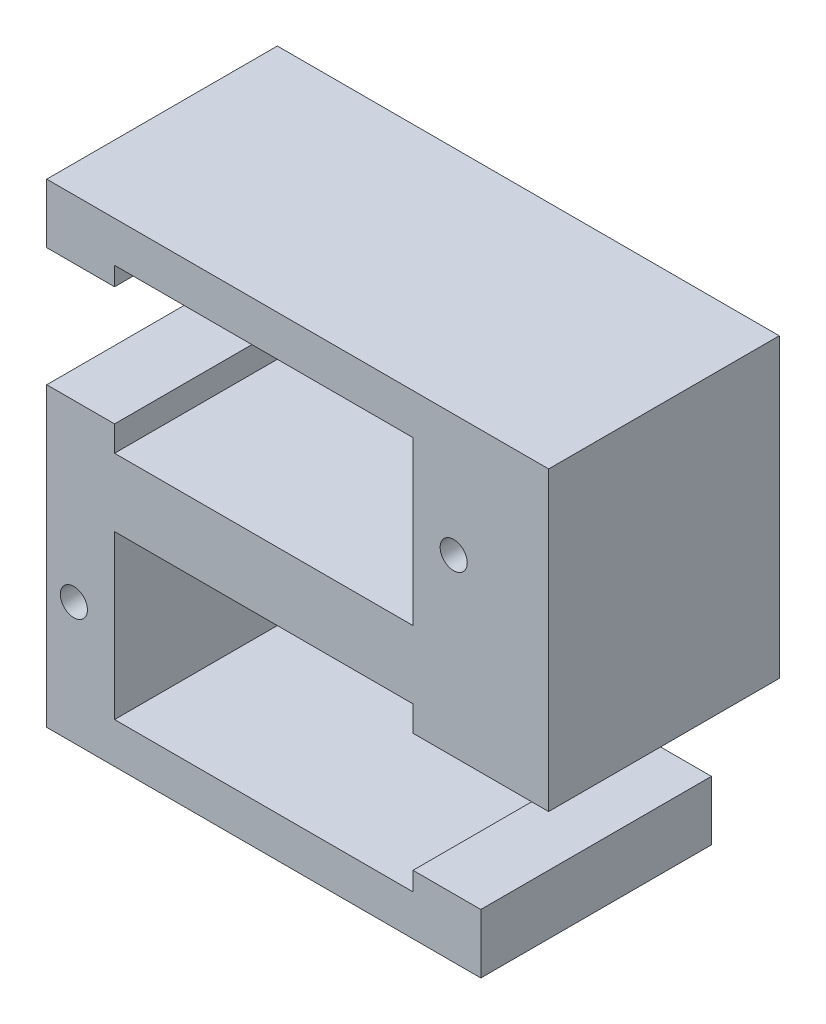
ISO-10303-21;
HEADER;
FILE_DESCRIPTION(('STEP AP214'),'2;1');
FILE_NAME('part.step','',(''),(''),'','','');
FILE_SCHEMA(('AUTOMOTIVE_DESIGN { 1 0 10303 214 1 1 1 1 }'));
ENDSEC;
DATA;
#1=APPLICATION_CONTEXT('core data for automotive mechanical design processes');
#2=APPLICATION_PROTOCOL_DEFINITION('international standard','automotive_design',2000,#1);
#3=PRODUCT_CONTEXT('',#1,'mechanical');
#4=PRODUCT('Part','Part','',(#3));
#5=PRODUCT_RELATED_PRODUCT_CATEGORY('part','',(#4));
#6=PRODUCT_DEFINITION_FORMATION('','',#4);
#7=PRODUCT_DEFINITION_CONTEXT('part definition',#1,'design');
#8=PRODUCT_DEFINITION('design','',#6,#7);
#9=PRODUCT_DEFINITION_SHAPE('','',#8);
#10=(LENGTH_UNIT() NAMED_UNIT(*) SI_UNIT(.MILLI.,.METRE.));
#11=(NAMED_UNIT(*) PLANE_ANGLE_UNIT() SI_UNIT($,.RADIAN.));
#12=(NAMED_UNIT(*) SI_UNIT($,.STERADIAN.) SOLID_ANGLE_UNIT());
#13=UNCERTAINTY_MEASURE_WITH_UNIT(LENGTH_MEASURE(1.E-05),#10,'distance_accuracy_value','');
#14=(GEOMETRIC_REPRESENTATION_CONTEXT(3) GLOBAL_UNCERTAINTY_ASSIGNED_CONTEXT((#13)) GLOBAL_UNIT_ASSIGNED_CONTEXT((#10,
#11,#12)) REPRESENTATION_CONTEXT('',''));
#15=CARTESIAN_POINT('',(0.,0.,0.));
#16=DIRECTION('',(0.,0.,1.));
#17=DIRECTION('',(1.,0.,0.));
#18=AXIS2_PLACEMENT_3D('',#15,#16,#17);
#19=CARTESIAN_POINT('',(16.1122382547684,0.,-35.));
#20=DIRECTION('',(-1.,0.,0.));
#21=DIRECTION('',(0.,-1.,0.));
#22=AXIS2_PLACEMENT_3D('',#19,#20,#21);
#23=PLANE('',#22);
#24=DIRECTION('',(0.,0.,1.));
#25=VECTOR('',#24,1.);
#26=CARTESIAN_POINT('',(16.1122382547684,40.9799365132959,-35.));
#27=LINE('',#26,#25);
#28=CARTESIAN_POINT('',(16.1122382547684,40.9799365132959,-32.));
#29=VERTEX_POINT('',#28);
#30=CARTESIAN_POINT('',(16.1122382547684,40.9799365132959,-15.));
#31=VERTEX_POINT('',#30);
#32=EDGE_CURVE('E45',#29,#31,#27,.T.);
#33=ORIENTED_EDGE('',*,*,#32,.F.);
#34=DIRECTION('',(0.,1.,0.));
#35=VECTOR('',#34,1.);
#36=CARTESIAN_POINT('',(16.1122382547684,75.9799365132959,-32.));
#37=LINE('',#36,#35);
#38=CARTESIAN_POINT('',(16.1122382547684,45.3549365132959,-32.));
#39=VERTEX_POINT('',#38);
#40=EDGE_CURVE('E212',#29,#39,#37,.T.);
#41=ORIENTED_EDGE('',*,*,#40,.T.);
#42=DIRECTION('',(0.,0.,-1.));
#43=VECTOR('',#42,1.);
#44=CARTESIAN_POINT('',(16.1122382547684,45.3549365132959,-35.));
#45=LINE('',#44,#43);
#46=CARTESIAN_POINT('',(16.1122382547684,45.3549365132959,-15.));
#47=VERTEX_POINT('',#46);
#48=EDGE_CURVE('E253',#47,#39,#45,.T.);
#49=ORIENTED_EDGE('',*,*,#48,.F.);
#50=DIRECTION('',(0.,1.,0.));
#51=VECTOR('',#50,1.);
#52=CARTESIAN_POINT('',(16.1122382547684,75.9799365132959,-15.));
#53=LINE('',#52,#51);
#54=EDGE_CURVE('E273',#31,#47,#53,.T.);
#55=ORIENTED_EDGE('',*,*,#54,.F.);
#56=EDGE_LOOP('',(#33,#41,#49,#55));
#57=FACE_BOUND('',#56,.T.);
#58=ADVANCED_FACE('F37',(#57),#23,.F.);
#59=CARTESIAN_POINT('',(11.1122380163498,0.,-35.));
#60=DIRECTION('',(-1.,0.,0.));
#61=DIRECTION('',(0.,0.,1.));
#62=AXIS2_PLACEMENT_3D('',#59,#60,#61);
#63=PLANE('',#62);
#64=DIRECTION('',(0.,1.,0.));
#65=VECTOR('',#64,1.);
#66=CARTESIAN_POINT('',(11.1122380163498,0.,-32.));
#67=LINE('',#66,#65);
#68=CARTESIAN_POINT('',(11.1122380163498,43.9799365132959,-32.));
#69=VERTEX_POINT('',#68);
#70=CARTESIAN_POINT('',(11.1122380163498,45.3549365132959,-32.));
#71=VERTEX_POINT('',#70);
#72=EDGE_CURVE('E52',#69,#71,#67,.T.);
#73=ORIENTED_EDGE('',*,*,#72,.F.);
#74=DIRECTION('',(0.,0.,1.));
#75=VECTOR('',#74,1.);
#76=CARTESIAN_POINT('',(11.1122380163498,43.9799365132959,-35.));
#77=LINE('',#76,#75);
#78=CARTESIAN_POINT('',(11.1122380163498,43.9799365132959,-15.));
#79=VERTEX_POINT('',#78);
#80=EDGE_CURVE('E327',#69,#79,#77,.T.);
#81=ORIENTED_EDGE('',*,*,#80,.T.);
#82=DIRECTION('',(0.,-1.,0.));
#83=VECTOR('',#82,1.);
#84=CARTESIAN_POINT('',(11.1122380163498,0.,-15.));
#85=LINE('',#84,#83);
#86=CARTESIAN_POINT('',(11.1122380163498,45.3549365132959,-15.));
#87=VERTEX_POINT('',#86);
#88=EDGE_CURVE('E290',#87,#79,#85,.T.);
#89=ORIENTED_EDGE('',*,*,#88,.F.);
#90=DIRECTION('',(0.,0.,-1.));
#91=VECTOR('',#90,1.);
#92=CARTESIAN_POINT('',(11.1122380163498,45.3549365132959,-35.));
#93=LINE('',#92,#91);
#94=EDGE_CURVE('E254',#87,#71,#93,.T.);
#95=ORIENTED_EDGE('',*,*,#94,.T.);
#96=EDGE_LOOP('',(#73,#81,#89,#95));
#97=FACE_BOUND('',#96,.T.);
#98=ADVANCED_FACE('F396',(#97),#63,.T.);
#99=CARTESIAN_POINT('',(-10.8877619836502,0.,-35.));
#100=DIRECTION('',(-1.,0.,0.));
#101=DIRECTION('',(0.,-1.,0.));
#102=AXIS2_PLACEMENT_3D('',#99,#100,#101);
#103=PLANE('',#102);
#104=DIRECTION('',(0.,0.,1.));
#105=VECTOR('',#104,1.);
#106=CARTESIAN_POINT('',(-10.8877619836502,60.9799365132958,-35.));
#107=LINE('',#106,#105);
#108=CARTESIAN_POINT('',(-10.8877619836502,60.9799365132958,-32.));
#109=VERTEX_POINT('',#108);
#110=CARTESIAN_POINT('',(-10.8877619836502,60.9799365132959,-15.));
#111=VERTEX_POINT('',#110);
#112=EDGE_CURVE('E317',#109,#111,#107,.T.);
#113=ORIENTED_EDGE('',*,*,#112,.F.);
#114=DIRECTION('',(0.,1.,0.));
#115=VECTOR('',#114,1.);
#116=CARTESIAN_POINT('',(-10.8877619836502,0.,-32.));
#117=LINE('',#116,#115);
#118=CARTESIAN_POINT('',(-10.8877619836502,62.8549365132958,-32.));
#119=VERTEX_POINT('',#118);
#120=EDGE_CURVE('E236',#109,#119,#117,.T.);
#121=ORIENTED_EDGE('',*,*,#120,.T.);
#122=DIRECTION('',(0.,0.,1.));
#123=VECTOR('',#122,1.);
#124=CARTESIAN_POINT('',(-10.8877619836502,62.8549365132958,-15.));
#125=LINE('',#124,#123);
#126=CARTESIAN_POINT('',(-10.8877619836502,62.8549365132958,-15.));
#127=VERTEX_POINT('',#126);
#128=EDGE_CURVE('E261',#119,#127,#125,.T.);
#129=ORIENTED_EDGE('',*,*,#128,.T.);
#130=DIRECTION('',(0.,-1.,0.));
#131=VECTOR('',#130,1.);
#132=CARTESIAN_POINT('',(-10.8877619836502,0.,-15.));
#133=LINE('',#132,#131);
#134=EDGE_CURVE('E307',#127,#111,#133,.T.);
#135=ORIENTED_EDGE('',*,*,#134,.T.);
#136=EDGE_LOOP('',(#113,#121,#129,#135));
#137=FACE_BOUND('',#136,.T.);
#138=ADVANCED_FACE('F374',(#137),#103,.F.);
#139=CARTESIAN_POINT('',(-15.8877622220688,0.,-35.));
#140=DIRECTION('',(-1.,0.,0.));
#141=DIRECTION('',(0.,-1.,0.));
#142=AXIS2_PLACEMENT_3D('',#139,#140,#141);
#143=PLANE('',#142);
#144=DIRECTION('',(0.,1.,0.));
#145=VECTOR('',#144,1.);
#146=CARTESIAN_POINT('',(-15.8877622220688,75.9799365132959,-32.));
#147=LINE('',#146,#145);
#148=CARTESIAN_POINT('',(-15.8877622220688,40.9799365132959,-32.));
#149=VERTEX_POINT('',#148);
#150=CARTESIAN_POINT('',(-15.8877622220688,62.8549365132958,-32.));
#151=VERTEX_POINT('',#150);
#152=EDGE_CURVE('E216',#149,#151,#147,.T.);
#153=ORIENTED_EDGE('',*,*,#152,.F.);
#154=DIRECTION('',(0.,0.,1.));
#155=VECTOR('',#154,1.);
#156=CARTESIAN_POINT('',(-15.8877622220688,40.9799365132959,-35.));
#157=LINE('',#156,#155);
#158=CARTESIAN_POINT('',(-15.8877622220688,40.9799365132959,-15.));
#159=VERTEX_POINT('',#158);
#160=EDGE_CURVE('E313',#149,#159,#157,.T.);
#161=ORIENTED_EDGE('',*,*,#160,.T.);
#162=DIRECTION('',(0.,1.,0.));
#163=VECTOR('',#162,1.);
#164=CARTESIAN_POINT('',(-15.8877622220688,75.9799365132959,-15.));
#165=LINE('',#164,#163);
#166=CARTESIAN_POINT('',(-15.8877622220688,62.8549365132958,-15.));
#167=VERTEX_POINT('',#166);
#168=EDGE_CURVE('E277',#159,#167,#165,.T.);
#169=ORIENTED_EDGE('',*,*,#168,.T.);
#170=DIRECTION('',(0.,0.,-1.));
#171=VECTOR('',#170,1.);
#172=CARTESIAN_POINT('',(-15.8877622220688,62.8549365132958,-15.));
#173=LINE('',#172,#171);
#174=EDGE_CURVE('E267',#167,#151,#173,.T.);
#175=ORIENTED_EDGE('',*,*,#174,.T.);
#176=EDGE_LOOP('',(#153,#161,#169,#175));
#177=FACE_BOUND('',#176,.T.);
#178=ADVANCED_FACE('F382',(#177),#143,.T.);
#179=CARTESIAN_POINT('',(-15.8877622220688,75.9799365132959,-15.));
#180=DIRECTION('',(0.,0.,-1.));
#181=DIRECTION('',(0.,1.,0.));
#182=AXIS2_PLACEMENT_3D('',#179,#180,#181);
#183=PLANE('',#182);
#184=CARTESIAN_POINT('',(14.1122382547684,66.9799365132959,-15.));
#185=DIRECTION('',(0.,0.,1.));
#186=DIRECTION('',(1.,0.,0.));
#187=AXIS2_PLACEMENT_3D('',#184,#185,#186);
#188=CIRCLE('',#187,0.999999999999961);
#189=CARTESIAN_POINT('',(15.1122382547684,66.9799365132959,-15.));
#190=VERTEX_POINT('',#189);
#191=EDGE_CURVE('E203',#190,#190,#188,.T.);
#192=ORIENTED_EDGE('',*,*,#191,.F.);
#193=EDGE_LOOP('',(#192));
#194=FACE_BOUND('',#193,.T.);
#195=CARTESIAN_POINT('',(-13.8877622220688,49.9799365132959,-15.));
#196=DIRECTION('',(0.,0.,1.));
#197=DIRECTION('',(1.,0.,0.));
#198=AXIS2_PLACEMENT_3D('',#195,#196,#197);
#199=CIRCLE('',#198,0.999999999999961);
#200=CARTESIAN_POINT('',(-12.8877622220688,49.9799365132959,-15.));
#201=VERTEX_POINT('',#200);
#202=EDGE_CURVE('E206',#201,#201,#199,.T.);
#203=ORIENTED_EDGE('',*,*,#202,.F.);
#204=EDGE_LOOP('',(#203));
#205=FACE_BOUND('',#204,.T.);
#206=ORIENTED_EDGE('',*,*,#54,.T.);
#207=DIRECTION('',(1.,0.,0.));
#208=VECTOR('',#207,1.);
#209=CARTESIAN_POINT('',(-15.8887622220688,45.3549365132958,-15.));
#210=LINE('',#209,#208);
#211=EDGE_CURVE('E185',#87,#47,#210,.T.);
#212=ORIENTED_EDGE('',*,*,#211,.F.);
#213=ORIENTED_EDGE('',*,*,#88,.T.);
#214=DIRECTION('',(-1.,0.,0.));
#215=VECTOR('',#214,1.);
#216=CARTESIAN_POINT('',(0.,43.9799365132959,-15.));
#217=LINE('',#216,#215);
#218=CARTESIAN_POINT('',(-10.8877619836502,43.9799365132959,-15.));
#219=VERTEX_POINT('',#218);
#220=EDGE_CURVE('E292',#79,#219,#217,.T.);
#221=ORIENTED_EDGE('',*,*,#220,.T.);
#222=DIRECTION('',(0.,-1.,0.));
#223=VECTOR('',#222,1.);
#224=CARTESIAN_POINT('',(-10.8877619836502,0.,-15.));
#225=LINE('',#224,#223);
#226=CARTESIAN_POINT('',(-10.8877619836502,55.9799365132959,-15.));
#227=VERTEX_POINT('',#226);
#228=EDGE_CURVE('E295',#227,#219,#225,.T.);
#229=ORIENTED_EDGE('',*,*,#228,.F.);
#230=DIRECTION('',(-1.,0.,0.));
#231=VECTOR('',#230,1.);
#232=CARTESIAN_POINT('',(0.,55.9799365132959,-15.));
#233=LINE('',#232,#231);
#234=CARTESIAN_POINT('',(11.1122380163498,55.9799365132959,-15.));
#235=VERTEX_POINT('',#234);
#236=EDGE_CURVE('E286',#235,#227,#233,.T.);
#237=ORIENTED_EDGE('',*,*,#236,.F.);
#238=CARTESIAN_POINT('',(11.1122380163498,54.1049365132959,-15.));
#239=VERTEX_POINT('',#238);
#240=EDGE_CURVE('E183',#235,#239,#85,.T.);
#241=ORIENTED_EDGE('',*,*,#240,.T.);
#242=DIRECTION('',(1.,0.,0.));
#243=VECTOR('',#242,1.);
#244=CARTESIAN_POINT('',(-15.8887622220688,54.1049365132958,-15.));
#245=LINE('',#244,#243);
#246=CARTESIAN_POINT('',(21.1122382547684,54.1049365132959,-15.));
#247=VERTEX_POINT('',#246);
#248=EDGE_CURVE('E175',#239,#247,#245,.T.);
#249=ORIENTED_EDGE('',*,*,#248,.T.);
#250=DIRECTION('',(0.,-1.,0.));
#251=VECTOR('',#250,1.);
#252=CARTESIAN_POINT('',(21.1122382547684,75.9799365132959,-15.));
#253=LINE('',#252,#251);
#254=CARTESIAN_POINT('',(21.1122382547684,75.9799365132959,-15.));
#255=VERTEX_POINT('',#254);
#256=EDGE_CURVE('E181',#255,#247,#253,.T.);
#257=ORIENTED_EDGE('',*,*,#256,.F.);
#258=DIRECTION('',(1.,0.,0.));
#259=VECTOR('',#258,1.);
#260=CARTESIAN_POINT('',(-15.8877622220688,75.9799365132959,-15.));
#261=LINE('',#260,#259);
#262=CARTESIAN_POINT('',(-15.8877622220688,75.9799365132959,-15.));
#263=VERTEX_POINT('',#262);
#264=EDGE_CURVE('E280',#263,#255,#261,.T.);
#265=ORIENTED_EDGE('',*,*,#264,.F.);
#266=CARTESIAN_POINT('',(-15.8877622220688,71.6049365132959,-15.));
#267=VERTEX_POINT('',#266);
#268=EDGE_CURVE('E281',#267,#263,#165,.T.);
#269=ORIENTED_EDGE('',*,*,#268,.F.);
#270=DIRECTION('',(-1.,0.,0.));
#271=VECTOR('',#270,1.);
#272=CARTESIAN_POINT('',(16.1132382547684,71.6049365132959,-15.));
#273=LINE('',#272,#271);
#274=CARTESIAN_POINT('',(-10.8877619836502,71.6049365132959,-15.));
#275=VERTEX_POINT('',#274);
#276=EDGE_CURVE('E266',#275,#267,#273,.T.);
#277=ORIENTED_EDGE('',*,*,#276,.F.);
#278=CARTESIAN_POINT('',(-10.8877619836502,72.9799366027028,-15.));
#279=VERTEX_POINT('',#278);
#280=EDGE_CURVE('E308',#279,#275,#133,.T.);
#281=ORIENTED_EDGE('',*,*,#280,.F.);
#282=DIRECTION('',(-1.,4.06395371900136E-09,0.));
#283=VECTOR('',#282,1.);
#284=CARTESIAN_POINT('',(2.96587084589218E-07,72.9799365584555,-15.));
#285=LINE('',#284,#283);
#286=CARTESIAN_POINT('',(11.1122380163498,72.9799365132958,-15.));
#287=VERTEX_POINT('',#286);
#288=EDGE_CURVE('E298',#287,#279,#285,.T.);
#289=ORIENTED_EDGE('',*,*,#288,.F.);
#290=DIRECTION('',(0.,-1.,0.));
#291=VECTOR('',#290,1.);
#292=CARTESIAN_POINT('',(11.1122380163498,0.,-15.));
#293=LINE('',#292,#291);
#294=CARTESIAN_POINT('',(11.1122380163498,60.9799365132958,-15.));
#295=VERTEX_POINT('',#294);
#296=EDGE_CURVE('E301',#287,#295,#293,.T.);
#297=ORIENTED_EDGE('',*,*,#296,.T.);
#298=DIRECTION('',(1.,0.,0.));
#299=VECTOR('',#298,1.);
#300=CARTESIAN_POINT('',(0.,60.9799365132959,-15.));
#301=LINE('',#300,#299);
#302=EDGE_CURVE('E304',#111,#295,#301,.T.);
#303=ORIENTED_EDGE('',*,*,#302,.F.);
#304=ORIENTED_EDGE('',*,*,#134,.F.);
#305=DIRECTION('',(-1.,0.,0.));
#306=VECTOR('',#305,1.);
#307=CARTESIAN_POINT('',(16.1132382547684,62.8549365132958,-15.));
#308=LINE('',#307,#306);
#309=EDGE_CURVE('E270',#127,#167,#308,.T.);
#310=ORIENTED_EDGE('',*,*,#309,.T.);
#311=ORIENTED_EDGE('',*,*,#168,.F.);
#312=DIRECTION('',(1.,0.,0.));
#313=VECTOR('',#312,1.);
#314=CARTESIAN_POINT('',(-15.8877622220688,40.9799365132959,-15.));
#315=LINE('',#314,#313);
#316=EDGE_CURVE('E283',#159,#31,#315,.T.);
#317=ORIENTED_EDGE('',*,*,#316,.T.);
#318=EDGE_LOOP('',(#206,#212,#213,#221,#229,#237,#241,#249,#257,#265,#269,#277,#281,#289,#297,
#303,#304,#310,#311,#317));
#319=FACE_BOUND('',#318,.T.);
#320=ADVANCED_FACE('F178',(#194,#205,#319),#183,.F.);
#321=CARTESIAN_POINT('',(0.,75.9799365132959,-35.));
#322=DIRECTION('',(0.,1.,0.));
#323=DIRECTION('',(0.,0.,1.));
#324=AXIS2_PLACEMENT_3D('',#321,#322,#323);
#325=PLANE('',#324);
#326=DIRECTION('',(-1.,0.,0.));
#327=VECTOR('',#326,1.);
#328=CARTESIAN_POINT('',(16.1122382547684,75.9799365132959,-32.));
#329=LINE('',#328,#327);
#330=CARTESIAN_POINT('',(21.1122382547684,75.9799365132959,-32.));
#331=VERTEX_POINT('',#330);
#332=CARTESIAN_POINT('',(-15.8877622220688,75.9799365132959,-32.));
#333=VERTEX_POINT('',#332);
#334=EDGE_CURVE('E218',#331,#333,#329,.T.);
#335=ORIENTED_EDGE('',*,*,#334,.T.);
#336=DIRECTION('',(0.,0.,1.));
#337=VECTOR('',#336,1.);
#338=CARTESIAN_POINT('',(-15.8877622220688,75.9799365132959,-35.));
#339=LINE('',#338,#337);
#340=EDGE_CURVE('E315',#333,#263,#339,.T.);
#341=ORIENTED_EDGE('',*,*,#340,.T.);
#342=ORIENTED_EDGE('',*,*,#264,.T.);
#343=DIRECTION('',(0.,0.,1.));
#344=VECTOR('',#343,1.);
#345=CARTESIAN_POINT('',(21.1122382547684,75.9799365132959,-15.));
#346=LINE('',#345,#344);
#347=EDGE_CURVE('E199',#331,#255,#346,.T.);
#348=ORIENTED_EDGE('',*,*,#347,.F.);
#349=EDGE_LOOP('',(#335,#341,#342,#348));
#350=FACE_BOUND('',#349,.T.);
#351=ADVANCED_FACE('F342',(#350),#325,.T.);
#352=CARTESIAN_POINT('',(0.,40.9799365132959,-35.));
#353=DIRECTION('',(0.,1.,0.));
#354=DIRECTION('',(0.,0.,1.));
#355=AXIS2_PLACEMENT_3D('',#352,#353,#354);
#356=PLANE('',#355);
#357=ORIENTED_EDGE('',*,*,#160,.F.);
#358=DIRECTION('',(-1.,0.,0.));
#359=VECTOR('',#358,1.);
#360=CARTESIAN_POINT('',(16.1122382547684,40.9799365132959,-32.));
#361=LINE('',#360,#359);
#362=EDGE_CURVE('E215',#29,#149,#361,.T.);
#363=ORIENTED_EDGE('',*,*,#362,.F.);
#364=ORIENTED_EDGE('',*,*,#32,.T.);
#365=ORIENTED_EDGE('',*,*,#316,.F.);
#366=EDGE_LOOP('',(#357,#363,#364,#365));
#367=FACE_BOUND('',#366,.T.);
#368=ADVANCED_FACE('F386',(#367),#356,.F.);
#369=DIRECTION('',(0.,0.,1.));
#370=VECTOR('',#369,1.);
#371=CARTESIAN_POINT('',(-10.8877619836502,71.6049365132959,-15.));
#372=LINE('',#371,#370);
#373=CARTESIAN_POINT('',(-10.8877619836502,71.6049365132959,-32.));
#374=VERTEX_POINT('',#373);
#375=EDGE_CURVE('E265',#374,#275,#372,.T.);
#376=ORIENTED_EDGE('',*,*,#375,.F.);
#377=DIRECTION('',(0.,1.,0.));
#378=VECTOR('',#377,1.);
#379=CARTESIAN_POINT('',(-10.8877619836502,0.,-32.));
#380=LINE('',#379,#378);
#381=CARTESIAN_POINT('',(-10.8877619836502,72.9799366027028,-32.));
#382=VERTEX_POINT('',#381);
#383=EDGE_CURVE('E247',#374,#382,#380,.T.);
#384=ORIENTED_EDGE('',*,*,#383,.T.);
#385=DIRECTION('',(0.,0.,1.));
#386=VECTOR('',#385,1.);
#387=CARTESIAN_POINT('',(-10.8877619836502,72.9799366027028,-35.));
#388=LINE('',#387,#386);
#389=EDGE_CURVE('E323',#382,#279,#388,.T.);
#390=ORIENTED_EDGE('',*,*,#389,.T.);
#391=ORIENTED_EDGE('',*,*,#280,.T.);
#392=EDGE_LOOP('',(#376,#384,#390,#391));
#393=FACE_BOUND('',#392,.T.);
#394=ADVANCED_FACE('F356',(#393),#103,.F.);
#395=CARTESIAN_POINT('',(0.,60.9799365132959,-35.));
#396=DIRECTION('',(0.,-1.,0.));
#397=DIRECTION('',(1.,0.,0.));
#398=AXIS2_PLACEMENT_3D('',#395,#396,#397);
#399=PLANE('',#398);
#400=DIRECTION('',(0.,0.,1.));
#401=VECTOR('',#400,1.);
#402=CARTESIAN_POINT('',(11.1122380163498,60.9799365132958,-35.));
#403=LINE('',#402,#401);
#404=CARTESIAN_POINT('',(11.1122380163498,60.9799365132958,-32.));
#405=VERTEX_POINT('',#404);
#406=EDGE_CURVE('E319',#405,#295,#403,.T.);
#407=ORIENTED_EDGE('',*,*,#406,.F.);
#408=DIRECTION('',(-1.,0.,0.));
#409=VECTOR('',#408,1.);
#410=CARTESIAN_POINT('',(0.,60.9799365132959,-32.));
#411=LINE('',#410,#409);
#412=EDGE_CURVE('E239',#405,#109,#411,.T.);
#413=ORIENTED_EDGE('',*,*,#412,.T.);
#414=ORIENTED_EDGE('',*,*,#112,.T.);
#415=ORIENTED_EDGE('',*,*,#302,.T.);
#416=EDGE_LOOP('',(#407,#413,#414,#415));
#417=FACE_BOUND('',#416,.T.);
#418=ADVANCED_FACE('F370',(#417),#399,.F.);
#419=DIRECTION('',(0.,1.,0.));
#420=VECTOR('',#419,1.);
#421=CARTESIAN_POINT('',(11.1122380163498,0.,-32.));
#422=LINE('',#421,#420);
#423=CARTESIAN_POINT('',(11.1122380163498,72.9799365132958,-32.));
#424=VERTEX_POINT('',#423);
#425=EDGE_CURVE('E242',#405,#424,#422,.T.);
#426=ORIENTED_EDGE('',*,*,#425,.F.);
#427=ORIENTED_EDGE('',*,*,#406,.T.);
#428=ORIENTED_EDGE('',*,*,#296,.F.);
#429=DIRECTION('',(0.,0.,1.));
#430=VECTOR('',#429,1.);
#431=CARTESIAN_POINT('',(11.1122380163498,72.9799365132958,-35.));
#432=LINE('',#431,#430);
#433=EDGE_CURVE('E321',#424,#287,#432,.T.);
#434=ORIENTED_EDGE('',*,*,#433,.F.);
#435=EDGE_LOOP('',(#426,#427,#428,#434));
#436=FACE_BOUND('',#435,.T.);
#437=ADVANCED_FACE('F365',(#436),#63,.T.);
#438=DIRECTION('',(0.,0.,1.));
#439=VECTOR('',#438,1.);
#440=CARTESIAN_POINT('',(-10.8877619836502,43.9799365132959,-35.));
#441=LINE('',#440,#439);
#442=CARTESIAN_POINT('',(-10.8877619836502,43.9799365132959,-32.));
#443=VERTEX_POINT('',#442);
#444=EDGE_CURVE('E325',#443,#219,#441,.T.);
#445=ORIENTED_EDGE('',*,*,#444,.F.);
#446=DIRECTION('',(0.,1.,0.));
#447=VECTOR('',#446,1.);
#448=CARTESIAN_POINT('',(-10.8877619836502,0.,-32.));
#449=LINE('',#448,#447);
#450=CARTESIAN_POINT('',(-10.8877619836502,55.9799365132959,-32.));
#451=VERTEX_POINT('',#450);
#452=EDGE_CURVE('E225',#443,#451,#449,.T.);
#453=ORIENTED_EDGE('',*,*,#452,.T.);
#454=DIRECTION('',(0.,0.,1.));
#455=VECTOR('',#454,1.);
#456=CARTESIAN_POINT('',(-10.8877619836502,55.9799365132959,-35.));
#457=LINE('',#456,#455);
#458=EDGE_CURVE('E311',#451,#227,#457,.T.);
#459=ORIENTED_EDGE('',*,*,#458,.T.);
#460=ORIENTED_EDGE('',*,*,#228,.T.);
#461=EDGE_LOOP('',(#445,#453,#459,#460));
#462=FACE_BOUND('',#461,.T.);
#463=ADVANCED_FACE('F334',(#462),#103,.F.);
#464=CARTESIAN_POINT('',(0.,43.9799365132959,-35.));
#465=DIRECTION('',(0.,1.,0.));
#466=DIRECTION('',(0.,0.,1.));
#467=AXIS2_PLACEMENT_3D('',#464,#465,#466);
#468=PLANE('',#467);
#469=DIRECTION('',(1.,0.,0.));
#470=VECTOR('',#469,1.);
#471=CARTESIAN_POINT('',(0.,43.9799365132959,-32.));
#472=LINE('',#471,#470);
#473=EDGE_CURVE('E223',#443,#69,#472,.T.);
#474=ORIENTED_EDGE('',*,*,#473,.F.);
#475=ORIENTED_EDGE('',*,*,#444,.T.);
#476=ORIENTED_EDGE('',*,*,#220,.F.);
#477=ORIENTED_EDGE('',*,*,#80,.F.);
#478=EDGE_LOOP('',(#474,#475,#476,#477));
#479=FACE_BOUND('',#478,.T.);
#480=ADVANCED_FACE('F400',(#479),#468,.T.);
#481=DIRECTION('',(0.,1.,0.));
#482=VECTOR('',#481,1.);
#483=CARTESIAN_POINT('',(11.1122380163498,0.,-32.));
#484=LINE('',#483,#482);
#485=CARTESIAN_POINT('',(11.1122380163498,54.1049365132959,-32.));
#486=VERTEX_POINT('',#485);
#487=CARTESIAN_POINT('',(11.1122380163498,55.9799365132959,-32.));
#488=VERTEX_POINT('',#487);
#489=EDGE_CURVE('E231',#486,#488,#484,.T.);
#490=ORIENTED_EDGE('',*,*,#489,.F.);
#491=DIRECTION('',(0.,0.,1.));
#492=VECTOR('',#491,1.);
#493=CARTESIAN_POINT('',(11.1122380163498,54.1049365132959,-35.));
#494=LINE('',#493,#492);
#495=EDGE_CURVE('E59',#486,#239,#494,.T.);
#496=ORIENTED_EDGE('',*,*,#495,.T.);
#497=ORIENTED_EDGE('',*,*,#240,.F.);
#498=DIRECTION('',(0.,0.,1.));
#499=VECTOR('',#498,1.);
#500=CARTESIAN_POINT('',(11.1122380163498,55.9799365132959,-35.));
#501=LINE('',#500,#499);
#502=EDGE_CURVE('E329',#488,#235,#501,.T.);
#503=ORIENTED_EDGE('',*,*,#502,.F.);
#504=EDGE_LOOP('',(#490,#496,#497,#503));
#505=FACE_BOUND('',#504,.T.);
#506=ADVANCED_FACE('F339',(#505),#63,.T.);
#507=CARTESIAN_POINT('',(2.96587084589218E-07,72.9799365584555,-35.));
#508=DIRECTION('',(4.06395371900136E-09,1.,0.));
#509=DIRECTION('',(-1.,4.06395371900136E-09,0.));
#510=AXIS2_PLACEMENT_3D('',#507,#508,#509);
#511=PLANE('',#510);
#512=ORIENTED_EDGE('',*,*,#389,.F.);
#513=DIRECTION('',(1.,-4.06395371900136E-09,0.));
#514=VECTOR('',#513,1.);
#515=CARTESIAN_POINT('',(2.96587084589218E-07,72.9799365584555,-32.));
#516=LINE('',#515,#514);
#517=EDGE_CURVE('E244',#382,#424,#516,.T.);
#518=ORIENTED_EDGE('',*,*,#517,.T.);
#519=ORIENTED_EDGE('',*,*,#433,.T.);
#520=ORIENTED_EDGE('',*,*,#288,.T.);
#521=EDGE_LOOP('',(#512,#518,#519,#520));
#522=FACE_BOUND('',#521,.T.);
#523=ADVANCED_FACE('F361',(#522),#511,.F.);
#524=CARTESIAN_POINT('',(0.,55.9799365132959,-35.));
#525=DIRECTION('',(0.,1.,0.));
#526=DIRECTION('',(0.,0.,1.));
#527=AXIS2_PLACEMENT_3D('',#524,#525,#526);
#528=PLANE('',#527);
#529=ORIENTED_EDGE('',*,*,#458,.F.);
#530=DIRECTION('',(1.,0.,0.));
#531=VECTOR('',#530,1.);
#532=CARTESIAN_POINT('',(0.,55.9799365132959,-32.));
#533=LINE('',#532,#531);
#534=EDGE_CURVE('E228',#451,#488,#533,.T.);
#535=ORIENTED_EDGE('',*,*,#534,.T.);
#536=ORIENTED_EDGE('',*,*,#502,.T.);
#537=ORIENTED_EDGE('',*,*,#236,.T.);
#538=EDGE_LOOP('',(#529,#535,#536,#537));
#539=FACE_BOUND('',#538,.T.);
#540=ADVANCED_FACE('F39',(#539),#528,.F.);
#541=CARTESIAN_POINT('',(-15.8877622220688,71.6049365132959,-32.));
#542=VERTEX_POINT('',#541);
#543=EDGE_CURVE('E211',#542,#333,#147,.T.);
#544=ORIENTED_EDGE('',*,*,#543,.F.);
#545=DIRECTION('',(0.,0.,-1.));
#546=VECTOR('',#545,1.);
#547=CARTESIAN_POINT('',(-15.8877622220688,71.6049365132959,-15.));
#548=LINE('',#547,#546);
#549=EDGE_CURVE('E262',#267,#542,#548,.T.);
#550=ORIENTED_EDGE('',*,*,#549,.F.);
#551=ORIENTED_EDGE('',*,*,#268,.T.);
#552=ORIENTED_EDGE('',*,*,#340,.F.);
#553=EDGE_LOOP('',(#544,#550,#551,#552));
#554=FACE_BOUND('',#553,.T.);
#555=ADVANCED_FACE('F351',(#554),#143,.T.);
#556=CARTESIAN_POINT('',(16.1132382547684,71.6049365132959,-15.));
#557=DIRECTION('',(0.,1.,0.));
#558=DIRECTION('',(-1.,0.,0.));
#559=AXIS2_PLACEMENT_3D('',#556,#557,#558);
#560=PLANE('',#559);
#561=ORIENTED_EDGE('',*,*,#549,.T.);
#562=DIRECTION('',(1.,0.,0.));
#563=VECTOR('',#562,1.);
#564=CARTESIAN_POINT('',(16.1132382547684,71.6049365132959,-32.));
#565=LINE('',#564,#563);
#566=EDGE_CURVE('E250',#542,#374,#565,.T.);
#567=ORIENTED_EDGE('',*,*,#566,.T.);
#568=ORIENTED_EDGE('',*,*,#375,.T.);
#569=ORIENTED_EDGE('',*,*,#276,.T.);
#570=EDGE_LOOP('',(#561,#567,#568,#569));
#571=FACE_BOUND('',#570,.T.);
#572=ADVANCED_FACE('F353',(#571),#560,.F.);
#573=CARTESIAN_POINT('',(16.1132382547684,62.8549365132958,-15.));
#574=DIRECTION('',(0.,1.,0.));
#575=DIRECTION('',(-1.,0.,0.));
#576=AXIS2_PLACEMENT_3D('',#573,#574,#575);
#577=PLANE('',#576);
#578=DIRECTION('',(1.,0.,0.));
#579=VECTOR('',#578,1.);
#580=CARTESIAN_POINT('',(16.1132382547684,62.8549365132958,-32.));
#581=LINE('',#580,#579);
#582=EDGE_CURVE('E234',#151,#119,#581,.T.);
#583=ORIENTED_EDGE('',*,*,#582,.F.);
#584=ORIENTED_EDGE('',*,*,#174,.F.);
#585=ORIENTED_EDGE('',*,*,#309,.F.);
#586=ORIENTED_EDGE('',*,*,#128,.F.);
#587=EDGE_LOOP('',(#583,#584,#585,#586));
#588=FACE_BOUND('',#587,.T.);
#589=ADVANCED_FACE('F476',(#588),#577,.T.);
#590=CARTESIAN_POINT('',(-15.8887622220688,54.1049365132958,-35.));
#591=DIRECTION('',(0.,1.,0.));
#592=DIRECTION('',(-1.,0.,0.));
#593=AXIS2_PLACEMENT_3D('',#590,#591,#592);
#594=PLANE('',#593);
#595=ORIENTED_EDGE('',*,*,#495,.F.);
#596=DIRECTION('',(1.,0.,0.));
#597=VECTOR('',#596,1.);
#598=CARTESIAN_POINT('',(-15.8887622220688,54.1049365132958,-32.));
#599=LINE('',#598,#597);
#600=CARTESIAN_POINT('',(21.1122382547684,54.1049365132959,-32.));
#601=VERTEX_POINT('',#600);
#602=EDGE_CURVE('E190',#486,#601,#599,.T.);
#603=ORIENTED_EDGE('',*,*,#602,.T.);
#604=DIRECTION('',(0.,0.,-1.));
#605=VECTOR('',#604,1.);
#606=CARTESIAN_POINT('',(21.1122382547684,54.1049365132959,-15.));
#607=LINE('',#606,#605);
#608=EDGE_CURVE('E188',#247,#601,#607,.T.);
#609=ORIENTED_EDGE('',*,*,#608,.F.);
#610=ORIENTED_EDGE('',*,*,#248,.F.);
#611=EDGE_LOOP('',(#595,#603,#609,#610));
#612=FACE_BOUND('',#611,.T.);
#613=ADVANCED_FACE('F189',(#612),#594,.F.);
#614=CARTESIAN_POINT('',(-15.8887622220688,45.3549365132958,-35.));
#615=DIRECTION('',(0.,-1.,0.));
#616=DIRECTION('',(1.,0.,0.));
#617=AXIS2_PLACEMENT_3D('',#614,#615,#616);
#618=PLANE('',#617);
#619=ORIENTED_EDGE('',*,*,#48,.T.);
#620=DIRECTION('',(-1.,0.,0.));
#621=VECTOR('',#620,1.);
#622=CARTESIAN_POINT('',(-15.8887622220688,45.3549365132958,-32.));
#623=LINE('',#622,#621);
#624=EDGE_CURVE('E11',#39,#71,#623,.T.);
#625=ORIENTED_EDGE('',*,*,#624,.T.);
#626=ORIENTED_EDGE('',*,*,#94,.F.);
#627=ORIENTED_EDGE('',*,*,#211,.T.);
#628=EDGE_LOOP('',(#619,#625,#626,#627));
#629=FACE_BOUND('',#628,.T.);
#630=ADVANCED_FACE('F393',(#629),#618,.F.);
#631=CARTESIAN_POINT('',(16.1122382547684,75.9799365132959,-32.));
#632=DIRECTION('',(0.,0.,1.));
#633=DIRECTION('',(0.,-1.,0.));
#634=AXIS2_PLACEMENT_3D('',#631,#632,#633);
#635=PLANE('',#634);
#636=ORIENTED_EDGE('',*,*,#543,.T.);
#637=ORIENTED_EDGE('',*,*,#334,.F.);
#638=DIRECTION('',(0.,1.,0.));
#639=VECTOR('',#638,1.);
#640=CARTESIAN_POINT('',(21.1122382547684,75.9799365132959,-32.));
#641=LINE('',#640,#639);
#642=EDGE_CURVE('E194',#601,#331,#641,.T.);
#643=ORIENTED_EDGE('',*,*,#642,.F.);
#644=ORIENTED_EDGE('',*,*,#602,.F.);
#645=ORIENTED_EDGE('',*,*,#489,.T.);
#646=ORIENTED_EDGE('',*,*,#534,.F.);
#647=ORIENTED_EDGE('',*,*,#452,.F.);
#648=ORIENTED_EDGE('',*,*,#473,.T.);
#649=ORIENTED_EDGE('',*,*,#72,.T.);
#650=ORIENTED_EDGE('',*,*,#624,.F.);
#651=ORIENTED_EDGE('',*,*,#40,.F.);
#652=ORIENTED_EDGE('',*,*,#362,.T.);
#653=ORIENTED_EDGE('',*,*,#152,.T.);
#654=ORIENTED_EDGE('',*,*,#582,.T.);
#655=ORIENTED_EDGE('',*,*,#120,.F.);
#656=ORIENTED_EDGE('',*,*,#412,.F.);
#657=ORIENTED_EDGE('',*,*,#425,.T.);
#658=ORIENTED_EDGE('',*,*,#517,.F.);
#659=ORIENTED_EDGE('',*,*,#383,.F.);
#660=ORIENTED_EDGE('',*,*,#566,.F.);
#661=EDGE_LOOP('',(#636,#637,#643,#644,#645,#646,#647,#648,#649,#650,#651,#652,#653,#654,#655,
#656,#657,#658,#659,#660));
#662=FACE_BOUND('',#661,.T.);
#663=ADVANCED_FACE('F340',(#662),#635,.F.);
#664=CARTESIAN_POINT('',(21.1122382547684,0.,0.));
#665=DIRECTION('',(1.,0.,0.));
#666=DIRECTION('',(0.,1.,0.));
#667=AXIS2_PLACEMENT_3D('',#664,#665,#666);
#668=PLANE('',#667);
#669=ORIENTED_EDGE('',*,*,#256,.T.);
#670=ORIENTED_EDGE('',*,*,#608,.T.);
#671=ORIENTED_EDGE('',*,*,#642,.T.);
#672=ORIENTED_EDGE('',*,*,#347,.T.);
#673=EDGE_LOOP('',(#669,#670,#671,#672));
#674=FACE_BOUND('',#673,.T.);
#675=ADVANCED_FACE('F197',(#674),#668,.T.);
#676=CARTESIAN_POINT('',(-13.8877622220688,49.9799365132959,-25.));
#677=DIRECTION('',(0.,0.,1.));
#678=DIRECTION('',(1.,0.,0.));
#679=AXIS2_PLACEMENT_3D('',#676,#677,#678);
#680=CYLINDRICAL_SURFACE('',#679,0.999999999999961);
#681=CARTESIAN_POINT('',(-13.8877622220688,49.9799365132959,-25.));
#682=DIRECTION('',(0.,0.,1.));
#683=DIRECTION('',(1.,0.,0.));
#684=AXIS2_PLACEMENT_3D('',#681,#682,#683);
#685=CIRCLE('',#684,0.999999999999961);
#686=CARTESIAN_POINT('',(-12.8877622220688,49.9799365132959,-25.));
#687=VERTEX_POINT('',#686);
#688=EDGE_CURVE('E445',#687,#687,#685,.T.);
#689=ORIENTED_EDGE('',*,*,#688,.F.);
#690=EDGE_LOOP('',(#689));
#691=FACE_BOUND('',#690,.T.);
#692=ORIENTED_EDGE('',*,*,#202,.T.);
#693=EDGE_LOOP('',(#692));
#694=FACE_BOUND('',#693,.T.);
#695=ADVANCED_FACE('F463',(#691,#694),#680,.F.);
#696=CARTESIAN_POINT('',(-13.8877622220688,49.9799365132959,-25.));
#697=DIRECTION('',(0.,0.,1.));
#698=DIRECTION('',(1.,0.,0.));
#699=AXIS2_PLACEMENT_3D('',#696,#697,#698);
#700=PLANE('',#699);
#701=ORIENTED_EDGE('',*,*,#688,.T.);
#702=EDGE_LOOP('',(#701));
#703=FACE_BOUND('',#702,.T.);
#704=ADVANCED_FACE('F454',(#703),#700,.T.);
#705=CARTESIAN_POINT('',(14.1122382547684,66.9799365132959,-25.));
#706=DIRECTION('',(0.,0.,1.));
#707=DIRECTION('',(1.,0.,0.));
#708=AXIS2_PLACEMENT_3D('',#705,#706,#707);
#709=CYLINDRICAL_SURFACE('',#708,0.999999999999961);
#710=CARTESIAN_POINT('',(14.1122382547684,66.9799365132959,-25.));
#711=DIRECTION('',(0.,0.,1.));
#712=DIRECTION('',(1.,0.,0.));
#713=AXIS2_PLACEMENT_3D('',#710,#711,#712);
#714=CIRCLE('',#713,0.999999999999961);
#715=CARTESIAN_POINT('',(15.1122382547684,66.9799365132959,-25.));
#716=VERTEX_POINT('',#715);
#717=EDGE_CURVE('E200',#716,#716,#714,.T.);
#718=ORIENTED_EDGE('',*,*,#717,.F.);
#719=EDGE_LOOP('',(#718));
#720=FACE_BOUND('',#719,.T.);
#721=ORIENTED_EDGE('',*,*,#191,.T.);
#722=EDGE_LOOP('',(#721));
#723=FACE_BOUND('',#722,.T.);
#724=ADVANCED_FACE('F451',(#720,#723),#709,.F.);
#725=CARTESIAN_POINT('',(14.1122382547684,66.9799365132959,-25.));
#726=DIRECTION('',(0.,0.,1.));
#727=DIRECTION('',(1.,0.,0.));
#728=AXIS2_PLACEMENT_3D('',#725,#726,#727);
#729=PLANE('',#728);
#730=ORIENTED_EDGE('',*,*,#717,.T.);
#731=EDGE_LOOP('',(#730));
#732=FACE_BOUND('',#731,.T.);
#733=ADVANCED_FACE('F453',(#732),#729,.T.);
#734=CLOSED_SHELL('',(#58,#98,#138,#178,#320,#351,#368,#394,#418,#437,#463,#480,#506,#523,#540,
#555,#572,#589,#613,#630,#663,#675,#695,#704,#724,#733));
#735=MANIFOLD_SOLID_BREP('B2',#734);
#736=ADVANCED_BREP_SHAPE_REPRESENTATION('',(#18,#735),#14);
#737=SHAPE_DEFINITION_REPRESENTATION(#9,#736);
ENDSEC;
END-ISO-10303-21;
